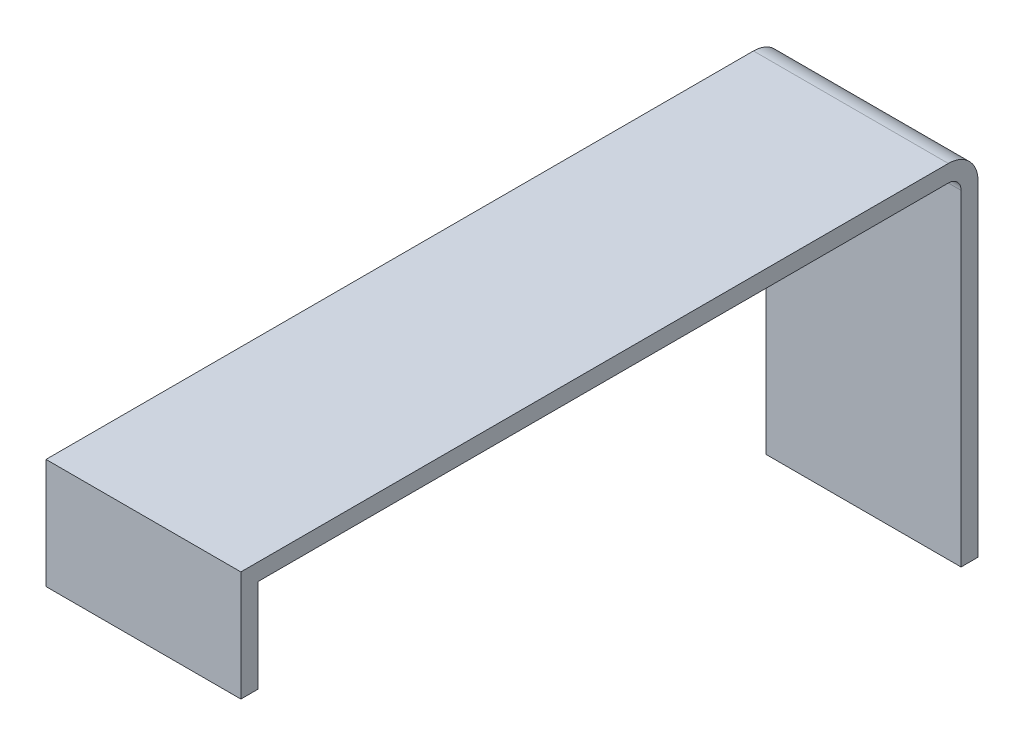
ISO-10303-21;
HEADER;
FILE_DESCRIPTION(('STEP AP214'),'2;1');
FILE_NAME('part.step','',(''),(''),'','','');
FILE_SCHEMA(('AUTOMOTIVE_DESIGN { 1 0 10303 214 1 1 1 1 }'));
ENDSEC;
DATA;
#1=APPLICATION_CONTEXT('core data for automotive mechanical design processes');
#2=APPLICATION_PROTOCOL_DEFINITION('international standard','automotive_design',2000,#1);
#3=PRODUCT_CONTEXT('',#1,'mechanical');
#4=PRODUCT('Part','Part','',(#3));
#5=PRODUCT_RELATED_PRODUCT_CATEGORY('part','',(#4));
#6=PRODUCT_DEFINITION_FORMATION('','',#4);
#7=PRODUCT_DEFINITION_CONTEXT('part definition',#1,'design');
#8=PRODUCT_DEFINITION('design','',#6,#7);
#9=PRODUCT_DEFINITION_SHAPE('','',#8);
#10=(LENGTH_UNIT() NAMED_UNIT(*) SI_UNIT(.MILLI.,.METRE.));
#11=(NAMED_UNIT(*) PLANE_ANGLE_UNIT() SI_UNIT($,.RADIAN.));
#12=(NAMED_UNIT(*) SI_UNIT($,.STERADIAN.) SOLID_ANGLE_UNIT());
#13=UNCERTAINTY_MEASURE_WITH_UNIT(LENGTH_MEASURE(1.E-05),#10,'distance_accuracy_value','');
#14=(GEOMETRIC_REPRESENTATION_CONTEXT(3) GLOBAL_UNCERTAINTY_ASSIGNED_CONTEXT((#13)) GLOBAL_UNIT_ASSIGNED_CONTEXT((#10,
#11,#12)) REPRESENTATION_CONTEXT('',''));
#15=CARTESIAN_POINT('',(0.,0.,0.));
#16=DIRECTION('',(0.,0.,1.));
#17=DIRECTION('',(1.,0.,0.));
#18=AXIS2_PLACEMENT_3D('',#15,#16,#17);
#19=CARTESIAN_POINT('',(3.30712530712528,40.,-28.3366093366093));
#20=DIRECTION('',(0.,1.,0.));
#21=DIRECTION('',(0.,0.,1.));
#22=AXIS2_PLACEMENT_3D('',#19,#20,#21);
#23=PLANE('',#22);
#24=DIRECTION('',(1.,0.,0.));
#25=VECTOR('',#24,1.);
#26=CARTESIAN_POINT('',(3.30712530712529,40.,53.1633906633907));
#27=LINE('',#26,#25);
#28=CARTESIAN_POINT('',(3.30712530712529,40.,53.1633906633907));
#29=VERTEX_POINT('',#28);
#30=CARTESIAN_POINT('',(26.3071253071253,40.,53.1633906633907));
#31=VERTEX_POINT('',#30);
#32=EDGE_CURVE('E130',#29,#31,#27,.T.);
#33=ORIENTED_EDGE('',*,*,#32,.F.);
#34=DIRECTION('',(0.,0.,1.));
#35=VECTOR('',#34,1.);
#36=CARTESIAN_POINT('',(3.30712530712528,40.,-28.3366093366093));
#37=LINE('',#36,#35);
#38=CARTESIAN_POINT('',(3.30712530712528,40.,-28.3366093366093));
#39=VERTEX_POINT('',#38);
#40=EDGE_CURVE('E136',#39,#29,#37,.T.);
#41=ORIENTED_EDGE('',*,*,#40,.F.);
#42=DIRECTION('',(1.,0.,0.));
#43=VECTOR('',#42,1.);
#44=CARTESIAN_POINT('',(3.30712530712528,40.,-28.3366093366093));
#45=LINE('',#44,#43);
#46=CARTESIAN_POINT('',(26.3071253071253,40.,-28.3366093366093));
#47=VERTEX_POINT('',#46);
#48=EDGE_CURVE('E159',#39,#47,#45,.T.);
#49=ORIENTED_EDGE('',*,*,#48,.T.);
#50=DIRECTION('',(0.,0.,1.));
#51=VECTOR('',#50,1.);
#52=CARTESIAN_POINT('',(26.3071253071253,40.,-28.3366093366093));
#53=LINE('',#52,#51);
#54=EDGE_CURVE('E148',#47,#31,#53,.T.);
#55=ORIENTED_EDGE('',*,*,#54,.T.);
#56=EDGE_LOOP('',(#33,#41,#49,#55));
#57=FACE_BOUND('',#56,.T.);
#58=ADVANCED_FACE('F33',(#57),#23,.F.);
#59=CARTESIAN_POINT('',(3.30712530712529,42.,-31.8366093366093));
#60=DIRECTION('',(1.,0.,0.));
#61=DIRECTION('',(0.,0.,-1.));
#62=AXIS2_PLACEMENT_3D('',#59,#60,#61);
#63=PLANE('',#62);
#64=DIRECTION('',(0.,0.,1.));
#65=VECTOR('',#64,1.);
#66=CARTESIAN_POINT('',(3.30712530712529,0.,-31.8366093366093));
#67=LINE('',#66,#65);
#68=CARTESIAN_POINT('',(3.30712530712529,0.,-31.8366093366093));
#69=VERTEX_POINT('',#68);
#70=CARTESIAN_POINT('',(3.30712530712527,0.,-29.8366093366093));
#71=VERTEX_POINT('',#70);
#72=EDGE_CURVE('E161',#69,#71,#67,.T.);
#73=ORIENTED_EDGE('',*,*,#72,.T.);
#74=DIRECTION('',(0.,1.,0.));
#75=VECTOR('',#74,1.);
#76=CARTESIAN_POINT('',(3.30712530712528,2.,-29.8366093366093));
#77=LINE('',#76,#75);
#78=CARTESIAN_POINT('',(3.3071253071253,38.5,-29.8366093366093));
#79=VERTEX_POINT('',#78);
#80=EDGE_CURVE('E145',#71,#79,#77,.T.);
#81=ORIENTED_EDGE('',*,*,#80,.T.);
#82=CARTESIAN_POINT('',(3.30712530712528,38.5,-28.3366093366093));
#83=DIRECTION('',(1.,0.,0.));
#84=DIRECTION('',(0.,0.,-1.));
#85=AXIS2_PLACEMENT_3D('',#82,#83,#84);
#86=CIRCLE('',#85,1.5);
#87=EDGE_CURVE('E48',#79,#39,#86,.T.);
#88=ORIENTED_EDGE('',*,*,#87,.T.);
#89=ORIENTED_EDGE('',*,*,#40,.T.);
#90=DIRECTION('',(0.,1.,0.));
#91=VECTOR('',#90,1.);
#92=CARTESIAN_POINT('',(3.30712530712529,29.,53.1633906633907));
#93=LINE('',#92,#91);
#94=CARTESIAN_POINT('',(3.30712530712529,29.,53.1633906633907));
#95=VERTEX_POINT('',#94);
#96=EDGE_CURVE('E113',#95,#29,#93,.T.);
#97=ORIENTED_EDGE('',*,*,#96,.F.);
#98=DIRECTION('',(0.,0.,-1.));
#99=VECTOR('',#98,1.);
#100=CARTESIAN_POINT('',(3.30712530712529,29.,55.1633906633907));
#101=LINE('',#100,#99);
#102=CARTESIAN_POINT('',(3.30712530712529,29.,55.1633906633907));
#103=VERTEX_POINT('',#102);
#104=EDGE_CURVE('E121',#103,#95,#101,.T.);
#105=ORIENTED_EDGE('',*,*,#104,.F.);
#106=DIRECTION('',(0.,-1.,0.));
#107=VECTOR('',#106,1.);
#108=CARTESIAN_POINT('',(3.30712530712531,42.,55.1633906633907));
#109=LINE('',#108,#107);
#110=CARTESIAN_POINT('',(3.30712530712531,42.,55.1633906633907));
#111=VERTEX_POINT('',#110);
#112=EDGE_CURVE('E182',#111,#103,#109,.T.);
#113=ORIENTED_EDGE('',*,*,#112,.F.);
#114=DIRECTION('',(0.,0.,1.));
#115=VECTOR('',#114,1.);
#116=CARTESIAN_POINT('',(3.30712530712529,42.,-31.8366093366093));
#117=LINE('',#116,#115);
#118=CARTESIAN_POINT('',(3.3071253071253,42.,-28.3366093366093));
#119=VERTEX_POINT('',#118);
#120=EDGE_CURVE('E163',#119,#111,#117,.T.);
#121=ORIENTED_EDGE('',*,*,#120,.F.);
#122=CARTESIAN_POINT('',(3.3071253071253,38.5,-28.3366093366093));
#123=DIRECTION('',(1.,0.,0.));
#124=DIRECTION('',(0.,0.,-1.));
#125=AXIS2_PLACEMENT_3D('',#122,#123,#124);
#126=CIRCLE('',#125,3.5);
#127=CARTESIAN_POINT('',(3.30712530712529,38.5,-31.8366093366093));
#128=VERTEX_POINT('',#127);
#129=EDGE_CURVE('E187',#119,#128,#126,.F.);
#130=ORIENTED_EDGE('',*,*,#129,.T.);
#131=DIRECTION('',(0.,-1.,0.));
#132=VECTOR('',#131,1.);
#133=CARTESIAN_POINT('',(3.30712530712529,42.,-31.8366093366093));
#134=LINE('',#133,#132);
#135=EDGE_CURVE('E171',#128,#69,#134,.T.);
#136=ORIENTED_EDGE('',*,*,#135,.T.);
#137=EDGE_LOOP('',(#73,#81,#88,#89,#97,#105,#113,#121,#130,#136));
#138=FACE_BOUND('',#137,.T.);
#139=ADVANCED_FACE('F134',(#138),#63,.F.);
#140=CARTESIAN_POINT('',(3.30712530712531,42.,55.1633906633907));
#141=DIRECTION('',(0.,0.,-1.));
#142=DIRECTION('',(-1.,0.,0.));
#143=AXIS2_PLACEMENT_3D('',#140,#141,#142);
#144=PLANE('',#143);
#145=ORIENTED_EDGE('',*,*,#112,.T.);
#146=DIRECTION('',(-1.,0.,0.));
#147=VECTOR('',#146,1.);
#148=CARTESIAN_POINT('',(3.30712530712529,29.,55.1633906633907));
#149=LINE('',#148,#147);
#150=CARTESIAN_POINT('',(26.3071253071253,29.,55.1633906633907));
#151=VERTEX_POINT('',#150);
#152=EDGE_CURVE('E127',#151,#103,#149,.T.);
#153=ORIENTED_EDGE('',*,*,#152,.F.);
#154=DIRECTION('',(0.,-1.,0.));
#155=VECTOR('',#154,1.);
#156=CARTESIAN_POINT('',(26.3071253071253,42.,55.1633906633907));
#157=LINE('',#156,#155);
#158=CARTESIAN_POINT('',(26.3071253071253,42.,55.1633906633907));
#159=VERTEX_POINT('',#158);
#160=EDGE_CURVE('E180',#159,#151,#157,.T.);
#161=ORIENTED_EDGE('',*,*,#160,.F.);
#162=DIRECTION('',(1.,0.,0.));
#163=VECTOR('',#162,1.);
#164=CARTESIAN_POINT('',(3.30712530712531,42.,55.1633906633907));
#165=LINE('',#164,#163);
#166=EDGE_CURVE('E165',#111,#159,#165,.T.);
#167=ORIENTED_EDGE('',*,*,#166,.F.);
#168=EDGE_LOOP('',(#145,#153,#161,#167));
#169=FACE_BOUND('',#168,.T.);
#170=ADVANCED_FACE('F203',(#169),#144,.F.);
#171=CARTESIAN_POINT('',(26.3071253071253,42.,-31.8366093366093));
#172=DIRECTION('',(-1.,0.,0.));
#173=DIRECTION('',(0.,0.,1.));
#174=AXIS2_PLACEMENT_3D('',#171,#172,#173);
#175=PLANE('',#174);
#176=DIRECTION('',(0.,1.,0.));
#177=VECTOR('',#176,1.);
#178=CARTESIAN_POINT('',(26.3071253071253,2.,-29.8366093366093));
#179=LINE('',#178,#177);
#180=CARTESIAN_POINT('',(26.3071253071253,0.,-29.8366093366093));
#181=VERTEX_POINT('',#180);
#182=CARTESIAN_POINT('',(26.3071253071253,38.5,-29.8366093366093));
#183=VERTEX_POINT('',#182);
#184=EDGE_CURVE('E140',#181,#183,#179,.T.);
#185=ORIENTED_EDGE('',*,*,#184,.F.);
#186=DIRECTION('',(0.,0.,-1.));
#187=VECTOR('',#186,1.);
#188=CARTESIAN_POINT('',(26.3071253071253,0.,-31.8366093366093));
#189=LINE('',#188,#187);
#190=CARTESIAN_POINT('',(26.3071253071253,0.,-31.8366093366093));
#191=VERTEX_POINT('',#190);
#192=EDGE_CURVE('E173',#181,#191,#189,.T.);
#193=ORIENTED_EDGE('',*,*,#192,.T.);
#194=DIRECTION('',(0.,-1.,0.));
#195=VECTOR('',#194,1.);
#196=CARTESIAN_POINT('',(26.3071253071253,42.,-31.8366093366093));
#197=LINE('',#196,#195);
#198=CARTESIAN_POINT('',(26.3071253071253,38.5,-31.8366093366093));
#199=VERTEX_POINT('',#198);
#200=EDGE_CURVE('E178',#199,#191,#197,.T.);
#201=ORIENTED_EDGE('',*,*,#200,.F.);
#202=CARTESIAN_POINT('',(26.3071253071253,38.5,-28.3366093366093));
#203=DIRECTION('',(-1.,0.,0.));
#204=DIRECTION('',(0.,0.,1.));
#205=AXIS2_PLACEMENT_3D('',#202,#203,#204);
#206=CIRCLE('',#205,3.5);
#207=CARTESIAN_POINT('',(26.3071253071253,42.,-28.3366093366093));
#208=VERTEX_POINT('',#207);
#209=EDGE_CURVE('E11',#199,#208,#206,.F.);
#210=ORIENTED_EDGE('',*,*,#209,.T.);
#211=DIRECTION('',(0.,0.,-1.));
#212=VECTOR('',#211,1.);
#213=CARTESIAN_POINT('',(26.3071253071253,42.,-31.8366093366093));
#214=LINE('',#213,#212);
#215=EDGE_CURVE('E168',#159,#208,#214,.T.);
#216=ORIENTED_EDGE('',*,*,#215,.F.);
#217=ORIENTED_EDGE('',*,*,#160,.T.);
#218=DIRECTION('',(0.,0.,1.));
#219=VECTOR('',#218,1.);
#220=CARTESIAN_POINT('',(26.3071253071253,29.,55.1633906633907));
#221=LINE('',#220,#219);
#222=CARTESIAN_POINT('',(26.3071253071253,29.,53.1633906633907));
#223=VERTEX_POINT('',#222);
#224=EDGE_CURVE('E120',#223,#151,#221,.T.);
#225=ORIENTED_EDGE('',*,*,#224,.F.);
#226=DIRECTION('',(0.,1.,0.));
#227=VECTOR('',#226,1.);
#228=CARTESIAN_POINT('',(26.3071253071253,29.,53.1633906633907));
#229=LINE('',#228,#227);
#230=EDGE_CURVE('E116',#223,#31,#229,.T.);
#231=ORIENTED_EDGE('',*,*,#230,.T.);
#232=ORIENTED_EDGE('',*,*,#54,.F.);
#233=CARTESIAN_POINT('',(26.3071253071253,38.5,-28.3366093366093));
#234=DIRECTION('',(1.,0.,0.));
#235=DIRECTION('',(0.,0.,-1.));
#236=AXIS2_PLACEMENT_3D('',#233,#234,#235);
#237=CIRCLE('',#236,1.5);
#238=EDGE_CURVE('E154',#183,#47,#237,.T.);
#239=ORIENTED_EDGE('',*,*,#238,.F.);
#240=EDGE_LOOP('',(#185,#193,#201,#210,#216,#217,#225,#231,#232,#239));
#241=FACE_BOUND('',#240,.T.);
#242=ADVANCED_FACE('F197',(#241),#175,.F.);
#243=CARTESIAN_POINT('',(3.30712530712529,42.,-31.8366093366093));
#244=DIRECTION('',(0.,0.,1.));
#245=DIRECTION('',(1.,0.,0.));
#246=AXIS2_PLACEMENT_3D('',#243,#244,#245);
#247=PLANE('',#246);
#248=ORIENTED_EDGE('',*,*,#135,.F.);
#249=DIRECTION('',(-1.,0.,0.));
#250=VECTOR('',#249,1.);
#251=CARTESIAN_POINT('',(26.3071253071253,38.5,-31.8366093366093));
#252=LINE('',#251,#250);
#253=EDGE_CURVE('E41',#128,#199,#252,.F.);
#254=ORIENTED_EDGE('',*,*,#253,.T.);
#255=ORIENTED_EDGE('',*,*,#200,.T.);
#256=DIRECTION('',(-1.,0.,0.));
#257=VECTOR('',#256,1.);
#258=CARTESIAN_POINT('',(3.30712530712529,0.,-31.8366093366093));
#259=LINE('',#258,#257);
#260=EDGE_CURVE('E166',#191,#69,#259,.T.);
#261=ORIENTED_EDGE('',*,*,#260,.T.);
#262=EDGE_LOOP('',(#248,#254,#255,#261));
#263=FACE_BOUND('',#262,.T.);
#264=ADVANCED_FACE('F191',(#263),#247,.F.);
#265=CARTESIAN_POINT('',(0.,42.,0.));
#266=DIRECTION('',(0.,1.,0.));
#267=DIRECTION('',(0.,0.,1.));
#268=AXIS2_PLACEMENT_3D('',#265,#266,#267);
#269=PLANE('',#268);
#270=ORIENTED_EDGE('',*,*,#215,.T.);
#271=DIRECTION('',(-1.,0.,0.));
#272=VECTOR('',#271,1.);
#273=CARTESIAN_POINT('',(3.30712530712529,42.,-28.3366093366093));
#274=LINE('',#273,#272);
#275=EDGE_CURVE('E184',#208,#119,#274,.T.);
#276=ORIENTED_EDGE('',*,*,#275,.T.);
#277=ORIENTED_EDGE('',*,*,#120,.T.);
#278=ORIENTED_EDGE('',*,*,#166,.T.);
#279=EDGE_LOOP('',(#270,#276,#277,#278));
#280=FACE_BOUND('',#279,.T.);
#281=ADVANCED_FACE('F199',(#280),#269,.T.);
#282=CARTESIAN_POINT('',(0.,0.,0.));
#283=DIRECTION('',(0.,1.,0.));
#284=DIRECTION('',(0.,0.,1.));
#285=AXIS2_PLACEMENT_3D('',#282,#283,#284);
#286=PLANE('',#285);
#287=ORIENTED_EDGE('',*,*,#192,.F.);
#288=DIRECTION('',(1.,0.,0.));
#289=VECTOR('',#288,1.);
#290=CARTESIAN_POINT('',(3.30712530712527,0.,-29.8366093366093));
#291=LINE('',#290,#289);
#292=EDGE_CURVE('E137',#71,#181,#291,.T.);
#293=ORIENTED_EDGE('',*,*,#292,.F.);
#294=ORIENTED_EDGE('',*,*,#72,.F.);
#295=ORIENTED_EDGE('',*,*,#260,.F.);
#296=EDGE_LOOP('',(#287,#293,#294,#295));
#297=FACE_BOUND('',#296,.T.);
#298=ADVANCED_FACE('F215',(#297),#286,.F.);
#299=CARTESIAN_POINT('',(0.,38.5,-28.3366093366093));
#300=DIRECTION('',(1.,0.,0.));
#301=DIRECTION('',(0.,0.,-1.));
#302=AXIS2_PLACEMENT_3D('',#299,#300,#301);
#303=CYLINDRICAL_SURFACE('',#302,3.5);
#304=ORIENTED_EDGE('',*,*,#209,.F.);
#305=ORIENTED_EDGE('',*,*,#253,.F.);
#306=ORIENTED_EDGE('',*,*,#129,.F.);
#307=ORIENTED_EDGE('',*,*,#275,.F.);
#308=EDGE_LOOP('',(#304,#305,#306,#307));
#309=FACE_BOUND('',#308,.T.);
#310=ADVANCED_FACE('F35',(#309),#303,.T.);
#311=CARTESIAN_POINT('',(3.30712530712528,38.5,-28.3366093366093));
#312=DIRECTION('',(1.,0.,0.));
#313=DIRECTION('',(0.,0.,-1.));
#314=AXIS2_PLACEMENT_3D('',#311,#312,#313);
#315=CYLINDRICAL_SURFACE('',#314,1.5);
#316=ORIENTED_EDGE('',*,*,#238,.T.);
#317=ORIENTED_EDGE('',*,*,#48,.F.);
#318=ORIENTED_EDGE('',*,*,#87,.F.);
#319=DIRECTION('',(1.,0.,0.));
#320=VECTOR('',#319,1.);
#321=CARTESIAN_POINT('',(3.30712530712528,38.5,-29.8366093366093));
#322=LINE('',#321,#320);
#323=EDGE_CURVE('E151',#79,#183,#322,.T.);
#324=ORIENTED_EDGE('',*,*,#323,.T.);
#325=EDGE_LOOP('',(#316,#317,#318,#324));
#326=FACE_BOUND('',#325,.T.);
#327=ADVANCED_FACE('F209',(#326),#315,.F.);
#328=CARTESIAN_POINT('',(3.30712530712528,2.,-29.8366093366093));
#329=DIRECTION('',(0.,0.,-1.));
#330=DIRECTION('',(-1.,0.,0.));
#331=AXIS2_PLACEMENT_3D('',#328,#329,#330);
#332=PLANE('',#331);
#333=ORIENTED_EDGE('',*,*,#184,.T.);
#334=ORIENTED_EDGE('',*,*,#323,.F.);
#335=ORIENTED_EDGE('',*,*,#80,.F.);
#336=ORIENTED_EDGE('',*,*,#292,.T.);
#337=EDGE_LOOP('',(#333,#334,#335,#336));
#338=FACE_BOUND('',#337,.T.);
#339=ADVANCED_FACE('F213',(#338),#332,.F.);
#340=CARTESIAN_POINT('',(3.30712530712529,29.,53.1633906633907));
#341=DIRECTION('',(0.,0.,1.));
#342=DIRECTION('',(1.,0.,0.));
#343=AXIS2_PLACEMENT_3D('',#340,#341,#342);
#344=PLANE('',#343);
#345=ORIENTED_EDGE('',*,*,#32,.T.);
#346=ORIENTED_EDGE('',*,*,#230,.F.);
#347=DIRECTION('',(1.,0.,0.));
#348=VECTOR('',#347,1.);
#349=CARTESIAN_POINT('',(3.30712530712529,29.,53.1633906633907));
#350=LINE('',#349,#348);
#351=EDGE_CURVE('E109',#95,#223,#350,.T.);
#352=ORIENTED_EDGE('',*,*,#351,.F.);
#353=ORIENTED_EDGE('',*,*,#96,.T.);
#354=EDGE_LOOP('',(#345,#346,#352,#353));
#355=FACE_BOUND('',#354,.T.);
#356=ADVANCED_FACE('F111',(#355),#344,.F.);
#357=CARTESIAN_POINT('',(0.,29.,0.));
#358=DIRECTION('',(0.,-1.,0.));
#359=DIRECTION('',(0.,0.,-1.));
#360=AXIS2_PLACEMENT_3D('',#357,#358,#359);
#361=PLANE('',#360);
#362=ORIENTED_EDGE('',*,*,#104,.T.);
#363=ORIENTED_EDGE('',*,*,#351,.T.);
#364=ORIENTED_EDGE('',*,*,#224,.T.);
#365=ORIENTED_EDGE('',*,*,#152,.T.);
#366=EDGE_LOOP('',(#362,#363,#364,#365));
#367=FACE_BOUND('',#366,.T.);
#368=ADVANCED_FACE('F125',(#367),#361,.T.);
#369=CLOSED_SHELL('',(#58,#139,#170,#242,#264,#281,#298,#310,#327,#339,#356,#368));
#370=MANIFOLD_SOLID_BREP('B2',#369);
#371=ADVANCED_BREP_SHAPE_REPRESENTATION('',(#18,#370),#14);
#372=SHAPE_DEFINITION_REPRESENTATION(#9,#371);
ENDSEC;
END-ISO-10303-21;
